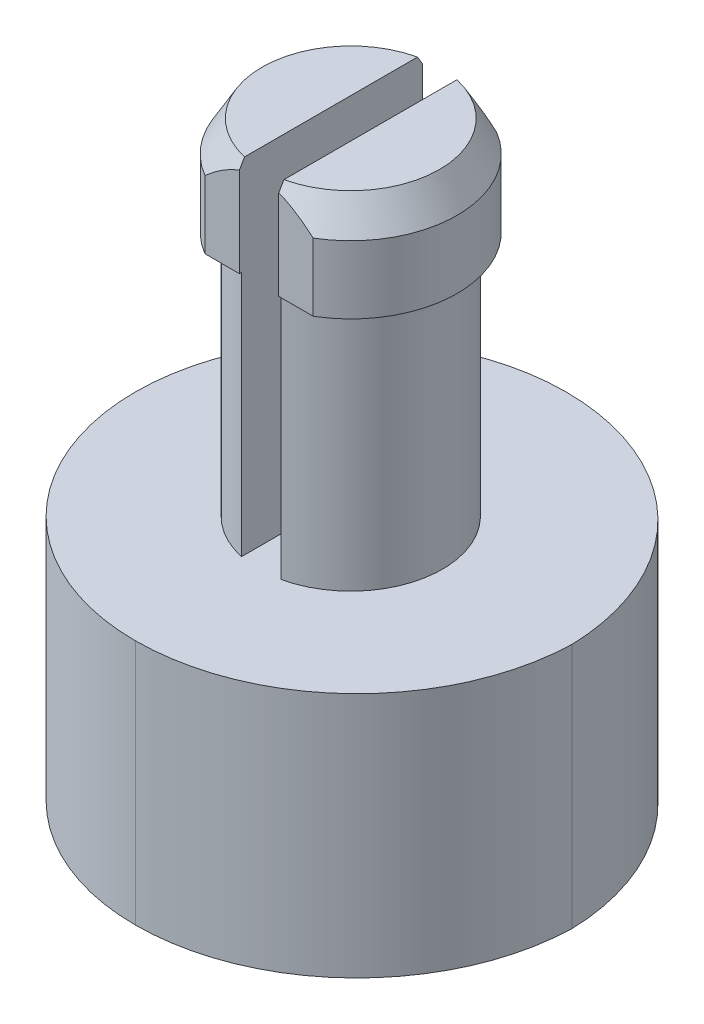
ISO-10303-21;
HEADER;
FILE_DESCRIPTION(('STEP AP214'),'2;1');
FILE_NAME('part.step','',(''),(''),'','','');
FILE_SCHEMA(('AUTOMOTIVE_DESIGN { 1 0 10303 214 1 1 1 1 }'));
ENDSEC;
DATA;
#1=APPLICATION_CONTEXT('core data for automotive mechanical design processes');
#2=APPLICATION_PROTOCOL_DEFINITION('international standard','automotive_design',2000,#1);
#3=PRODUCT_CONTEXT('',#1,'mechanical');
#4=PRODUCT('Part','Part','',(#3));
#5=PRODUCT_RELATED_PRODUCT_CATEGORY('part','',(#4));
#6=PRODUCT_DEFINITION_FORMATION('','',#4);
#7=PRODUCT_DEFINITION_CONTEXT('part definition',#1,'design');
#8=PRODUCT_DEFINITION('design','',#6,#7);
#9=PRODUCT_DEFINITION_SHAPE('','',#8);
#10=(LENGTH_UNIT() NAMED_UNIT(*) SI_UNIT(.MILLI.,.METRE.));
#11=(NAMED_UNIT(*) PLANE_ANGLE_UNIT() SI_UNIT($,.RADIAN.));
#12=(NAMED_UNIT(*) SI_UNIT($,.STERADIAN.) SOLID_ANGLE_UNIT());
#13=UNCERTAINTY_MEASURE_WITH_UNIT(LENGTH_MEASURE(1.E-05),#10,'distance_accuracy_value','');
#14=(GEOMETRIC_REPRESENTATION_CONTEXT(3) GLOBAL_UNCERTAINTY_ASSIGNED_CONTEXT((#13)) GLOBAL_UNIT_ASSIGNED_CONTEXT((#10,
#11,#12)) REPRESENTATION_CONTEXT('',''));
#15=CARTESIAN_POINT('',(0.,0.,0.));
#16=DIRECTION('',(0.,0.,1.));
#17=DIRECTION('',(1.,0.,0.));
#18=AXIS2_PLACEMENT_3D('',#15,#16,#17);
#19=CARTESIAN_POINT('',(9.652,6.35,5.55625));
#20=DIRECTION('',(0.,-1.,0.));
#21=DIRECTION('',(0.,0.,-1.));
#22=AXIS2_PLACEMENT_3D('',#19,#20,#21);
#23=CYLINDRICAL_SURFACE('',#22,2.365);
#24=DIRECTION('',(0.,-1.,0.));
#25=VECTOR('',#24,1.);
#26=CARTESIAN_POINT('',(9.144,6.35,7.86604674430457));
#27=LINE('',#26,#25);
#28=CARTESIAN_POINT('',(9.144,6.35,7.86604674430457));
#29=VERTEX_POINT('',#28);
#30=CARTESIAN_POINT('',(9.144,0.,7.86604674430457));
#31=VERTEX_POINT('',#30);
#32=EDGE_CURVE('E342',#29,#31,#27,.T.);
#33=ORIENTED_EDGE('',*,*,#32,.F.);
#34=CARTESIAN_POINT('',(9.652,6.35,5.55625));
#35=DIRECTION('',(0.,1.,0.));
#36=DIRECTION('',(0.,0.,1.));
#37=AXIS2_PLACEMENT_3D('',#34,#35,#36);
#38=CIRCLE('',#37,2.365);
#39=CARTESIAN_POINT('',(9.144,6.35,3.24645325569543));
#40=VERTEX_POINT('',#39);
#41=EDGE_CURVE('E369',#40,#29,#38,.T.);
#42=ORIENTED_EDGE('',*,*,#41,.F.);
#43=DIRECTION('',(0.,-1.,0.));
#44=VECTOR('',#43,1.);
#45=CARTESIAN_POINT('',(9.144,6.35,3.24645325569543));
#46=LINE('',#45,#44);
#47=CARTESIAN_POINT('',(9.144,0.,3.24645325569543));
#48=VERTEX_POINT('',#47);
#49=EDGE_CURVE('E337',#48,#40,#46,.F.);
#50=ORIENTED_EDGE('',*,*,#49,.F.);
#51=CARTESIAN_POINT('',(9.652,0.,5.55625));
#52=DIRECTION('',(0.,1.,0.));
#53=DIRECTION('',(0.,0.,1.));
#54=AXIS2_PLACEMENT_3D('',#51,#52,#53);
#55=CIRCLE('',#54,2.365);
#56=EDGE_CURVE('E366',#48,#31,#55,.T.);
#57=ORIENTED_EDGE('',*,*,#56,.T.);
#58=EDGE_LOOP('',(#33,#42,#50,#57));
#59=FACE_BOUND('',#58,.T.);
#60=ADVANCED_FACE('F35',(#59),#23,.T.);
#61=DIRECTION('',(0.,-1.,0.));
#62=VECTOR('',#61,1.);
#63=CARTESIAN_POINT('',(10.16,6.35,3.24645325569543));
#64=LINE('',#63,#62);
#65=CARTESIAN_POINT('',(10.16,6.35,3.24645325569543));
#66=VERTEX_POINT('',#65);
#67=CARTESIAN_POINT('',(10.16,0.,3.24645325569543));
#68=VERTEX_POINT('',#67);
#69=EDGE_CURVE('E324',#66,#68,#64,.T.);
#70=ORIENTED_EDGE('',*,*,#69,.F.);
#71=CARTESIAN_POINT('',(10.16,6.35,7.86604674430457));
#72=VERTEX_POINT('',#71);
#73=EDGE_CURVE('E192',#72,#66,#38,.T.);
#74=ORIENTED_EDGE('',*,*,#73,.F.);
#75=DIRECTION('',(0.,-1.,0.));
#76=VECTOR('',#75,1.);
#77=CARTESIAN_POINT('',(10.16,6.35,7.86604674430457));
#78=LINE('',#77,#76);
#79=CARTESIAN_POINT('',(10.16,0.,7.86604674430457));
#80=VERTEX_POINT('',#79);
#81=EDGE_CURVE('E330',#80,#72,#78,.F.);
#82=ORIENTED_EDGE('',*,*,#81,.F.);
#83=EDGE_CURVE('E370',#80,#68,#55,.T.);
#84=ORIENTED_EDGE('',*,*,#83,.T.);
#85=EDGE_LOOP('',(#70,#74,#82,#84));
#86=FACE_BOUND('',#85,.T.);
#87=ADVANCED_FACE('F291',(#86),#23,.T.);
#88=CARTESIAN_POINT('',(9.652,6.35,5.55625));
#89=DIRECTION('',(0.,1.,0.));
#90=DIRECTION('',(0.,0.,1.));
#91=AXIS2_PLACEMENT_3D('',#88,#89,#90);
#92=PLANE('',#91);
#93=DIRECTION('',(0.,0.,1.));
#94=VECTOR('',#93,1.);
#95=CARTESIAN_POINT('',(10.16,6.35,5.55625));
#96=LINE('',#95,#94);
#97=CARTESIAN_POINT('',(10.16,6.35,3.19125));
#98=VERTEX_POINT('',#97);
#99=EDGE_CURVE('E322',#98,#66,#96,.T.);
#100=ORIENTED_EDGE('',*,*,#99,.F.);
#101=DIRECTION('',(-1.,0.,0.));
#102=VECTOR('',#101,1.);
#103=CARTESIAN_POINT('',(8.25654631033488,6.35,3.19125));
#104=LINE('',#103,#102);
#105=CARTESIAN_POINT('',(11.0474536896651,6.35,3.19125));
#106=VERTEX_POINT('',#105);
#107=EDGE_CURVE('E355',#106,#98,#104,.T.);
#108=ORIENTED_EDGE('',*,*,#107,.F.);
#109=CARTESIAN_POINT('',(9.652,6.35,5.55625));
#110=DIRECTION('',(0.,1.,0.));
#111=DIRECTION('',(0.,0.,1.));
#112=AXIS2_PLACEMENT_3D('',#109,#110,#111);
#113=CIRCLE('',#112,2.746);
#114=CARTESIAN_POINT('',(11.0474536896651,6.35,7.92125));
#115=VERTEX_POINT('',#114);
#116=EDGE_CURVE('E351',#115,#106,#113,.T.);
#117=ORIENTED_EDGE('',*,*,#116,.F.);
#118=DIRECTION('',(1.,0.,0.));
#119=VECTOR('',#118,1.);
#120=CARTESIAN_POINT('',(8.25654631033488,6.35,7.92125));
#121=LINE('',#120,#119);
#122=CARTESIAN_POINT('',(10.16,6.35,7.92125));
#123=VERTEX_POINT('',#122);
#124=EDGE_CURVE('E347',#123,#115,#121,.T.);
#125=ORIENTED_EDGE('',*,*,#124,.F.);
#126=EDGE_CURVE('E325',#72,#123,#96,.T.);
#127=ORIENTED_EDGE('',*,*,#126,.F.);
#128=ORIENTED_EDGE('',*,*,#73,.T.);
#129=EDGE_LOOP('',(#100,#108,#117,#125,#127,#128));
#130=FACE_BOUND('',#129,.T.);
#131=ADVANCED_FACE('F241',(#130),#92,.F.);
#132=DIRECTION('',(0.,0.,-1.));
#133=VECTOR('',#132,1.);
#134=CARTESIAN_POINT('',(9.144,6.35,5.55625));
#135=LINE('',#134,#133);
#136=CARTESIAN_POINT('',(9.144,6.35,7.92125));
#137=VERTEX_POINT('',#136);
#138=EDGE_CURVE('E338',#137,#29,#135,.T.);
#139=ORIENTED_EDGE('',*,*,#138,.F.);
#140=CARTESIAN_POINT('',(8.25654631033488,6.35,7.92125));
#141=VERTEX_POINT('',#140);
#142=EDGE_CURVE('E348',#141,#137,#121,.T.);
#143=ORIENTED_EDGE('',*,*,#142,.F.);
#144=CARTESIAN_POINT('',(9.652,6.35,5.55625));
#145=DIRECTION('',(0.,1.,0.));
#146=DIRECTION('',(0.,0.,1.));
#147=AXIS2_PLACEMENT_3D('',#144,#145,#146);
#148=CIRCLE('',#147,2.746);
#149=CARTESIAN_POINT('',(8.25654631033488,6.35,3.19125));
#150=VERTEX_POINT('',#149);
#151=EDGE_CURVE('E344',#150,#141,#148,.T.);
#152=ORIENTED_EDGE('',*,*,#151,.F.);
#153=CARTESIAN_POINT('',(9.144,6.35,3.19125));
#154=VERTEX_POINT('',#153);
#155=EDGE_CURVE('E354',#154,#150,#104,.T.);
#156=ORIENTED_EDGE('',*,*,#155,.F.);
#157=EDGE_CURVE('E335',#40,#154,#135,.T.);
#158=ORIENTED_EDGE('',*,*,#157,.F.);
#159=ORIENTED_EDGE('',*,*,#41,.T.);
#160=EDGE_LOOP('',(#139,#143,#152,#156,#158,#159));
#161=FACE_BOUND('',#160,.T.);
#162=ADVANCED_FACE('F254',(#161),#92,.F.);
#163=CARTESIAN_POINT('',(8.25654631033488,8.89,7.92125));
#164=DIRECTION('',(0.,0.,-1.));
#165=DIRECTION('',(-1.,0.,0.));
#166=AXIS2_PLACEMENT_3D('',#163,#164,#165);
#167=PLANE('',#166);
#168=DIRECTION('',(0.,-1.,0.));
#169=VECTOR('',#168,1.);
#170=CARTESIAN_POINT('',(9.144,8.89,7.92125));
#171=LINE('',#170,#169);
#172=CARTESIAN_POINT('',(9.144,8.66272799383826,7.92125));
#173=VERTEX_POINT('',#172);
#174=EDGE_CURVE('E340',#173,#137,#171,.T.);
#175=ORIENTED_EDGE('',*,*,#174,.F.);
#176=CARTESIAN_POINT('',(9.144,8.66272799383826,7.92125));
#177=CARTESIAN_POINT('',(9.07897126611526,8.6390470148658,7.92125));
#178=CARTESIAN_POINT('',(9.01546129013959,8.61162898778716,7.92125));
#179=CARTESIAN_POINT('',(8.8915607613612,8.55085046003931,7.92125));
#180=CARTESIAN_POINT('',(8.83116151061707,8.51750783582994,7.92125));
#181=CARTESIAN_POINT('',(8.71378542197152,8.44661993005787,7.92125));
#182=CARTESIAN_POINT('',(8.65677980749075,8.40912132402861,7.92125));
#183=CARTESIAN_POINT('',(8.5451916908207,8.33063180561295,7.92125));
#184=CARTESIAN_POINT('',(8.4906105700596,8.28963894012723,7.92125));
#185=CARTESIAN_POINT('',(8.40638728555352,8.2229807806104,7.92125));
#186=CARTESIAN_POINT('',(8.37602017450452,8.19821960407329,7.92125));
#187=CARTESIAN_POINT('',(8.31584943740183,8.14783728650711,7.92125));
#188=CARTESIAN_POINT('',(8.28604781310869,8.12221375232005,7.92125));
#189=CARTESIAN_POINT('',(8.25654631033456,8.0962500000004,7.92125));
#190=B_SPLINE_CURVE_WITH_KNOTS('',3,(#176,#177,#178,#179,#180,#181,#182,#183,#184,#185,#186,
#187,#188,#189),.UNSPECIFIED.,.F.,.F.,(4,2,2,2,2,2,4),(0.,0.207289242942653,0.413963330448958,
0.618514980827537,0.823181723630413,0.940718514376475,1.05861389299853),.UNSPECIFIED.);
#191=CARTESIAN_POINT('',(8.25654631033488,8.09625,7.92125));
#192=VERTEX_POINT('',#191);
#193=EDGE_CURVE('E62',#173,#192,#190,.T.);
#194=ORIENTED_EDGE('',*,*,#193,.T.);
#195=DIRECTION('',(0.,-1.,0.));
#196=VECTOR('',#195,1.);
#197=CARTESIAN_POINT('',(8.25654631033488,8.89,7.92125));
#198=LINE('',#197,#196);
#199=EDGE_CURVE('E364',#192,#141,#198,.T.);
#200=ORIENTED_EDGE('',*,*,#199,.T.);
#201=ORIENTED_EDGE('',*,*,#142,.T.);
#202=EDGE_LOOP('',(#175,#194,#200,#201));
#203=FACE_BOUND('',#202,.T.);
#204=ADVANCED_FACE('F250',(#203),#167,.F.);
#205=DIRECTION('',(0.,-1.,0.));
#206=VECTOR('',#205,1.);
#207=CARTESIAN_POINT('',(11.0474536896651,8.89,7.92125));
#208=LINE('',#207,#206);
#209=CARTESIAN_POINT('',(11.0474536896651,8.09625,7.92125));
#210=VERTEX_POINT('',#209);
#211=EDGE_CURVE('E362',#210,#115,#208,.T.);
#212=ORIENTED_EDGE('',*,*,#211,.F.);
#213=CARTESIAN_POINT('',(11.0474536896651,8.09625,7.92125));
#214=CARTESIAN_POINT('',(10.9891313426045,8.14752147950845,7.92125));
#215=CARTESIAN_POINT('',(10.9296323591011,8.19756383661311,7.92125));
#216=CARTESIAN_POINT('',(10.8075145417379,8.29436242360265,7.92125));
#217=CARTESIAN_POINT('',(10.7448807638123,8.34109970823,7.92125));
#218=CARTESIAN_POINT('',(10.6176219025196,8.42900412363934,7.92125));
#219=CARTESIAN_POINT('',(10.5530615079704,8.47026380538079,7.92125));
#220=CARTESIAN_POINT('',(10.4205320210095,8.54666017956444,7.92125));
#221=CARTESIAN_POINT('',(10.3525715716221,8.58181147328913,7.92125));
#222=CARTESIAN_POINT('',(10.2626889087194,8.62193408697179,7.92125));
#223=CARTESIAN_POINT('',(10.2423906805197,8.63059297138322,7.92125));
#224=CARTESIAN_POINT('',(10.2014443704591,8.64720885797594,7.92125));
#225=CARTESIAN_POINT('',(10.1807954814522,8.65516386904612,7.92125));
#226=CARTESIAN_POINT('',(10.16,8.66272799383834,7.92125));
#227=B_SPLINE_CURVE_WITH_KNOTS('',3,(#213,#214,#215,#216,#217,#218,#219,#220,#221,#222,#223,
#224,#225,#226),.UNSPECIFIED.,.F.,.F.,(4,2,2,2,2,2,4),(0.,0.233057041170053,0.467356798114246,
0.696980507606663,0.926047547621464,0.9922400607786,1.05861420167723),.UNSPECIFIED.);
#228=CARTESIAN_POINT('',(10.16,8.66272799383828,7.92125));
#229=VERTEX_POINT('',#228);
#230=EDGE_CURVE('E257',#210,#229,#227,.T.);
#231=ORIENTED_EDGE('',*,*,#230,.T.);
#232=DIRECTION('',(0.,1.,0.));
#233=VECTOR('',#232,1.);
#234=CARTESIAN_POINT('',(10.16,8.89,7.92125));
#235=LINE('',#234,#233);
#236=EDGE_CURVE('E327',#123,#229,#235,.T.);
#237=ORIENTED_EDGE('',*,*,#236,.F.);
#238=ORIENTED_EDGE('',*,*,#124,.T.);
#239=EDGE_LOOP('',(#212,#231,#237,#238));
#240=FACE_BOUND('',#239,.T.);
#241=ADVANCED_FACE('F239',(#240),#167,.F.);
#242=CARTESIAN_POINT('',(8.25654631033488,8.89,3.19125));
#243=DIRECTION('',(0.,0.,1.));
#244=DIRECTION('',(1.,0.,0.));
#245=AXIS2_PLACEMENT_3D('',#242,#243,#244);
#246=PLANE('',#245);
#247=DIRECTION('',(0.,-1.,0.));
#248=VECTOR('',#247,1.);
#249=CARTESIAN_POINT('',(8.25654631033488,8.89,3.19125));
#250=LINE('',#249,#248);
#251=CARTESIAN_POINT('',(8.25654631033488,8.09625,3.19125));
#252=VERTEX_POINT('',#251);
#253=EDGE_CURVE('E358',#252,#150,#250,.T.);
#254=ORIENTED_EDGE('',*,*,#253,.F.);
#255=CARTESIAN_POINT('',(8.25654631033488,8.09625,3.19125));
#256=CARTESIAN_POINT('',(8.3148686573955,8.14752147950845,3.19125));
#257=CARTESIAN_POINT('',(8.37436764089892,8.1975638366131,3.19125));
#258=CARTESIAN_POINT('',(8.49648545826208,8.29436242360264,3.19125));
#259=CARTESIAN_POINT('',(8.55911923618774,8.34109970822998,3.19125));
#260=CARTESIAN_POINT('',(8.68637809748044,8.42900412363933,3.19125));
#261=CARTESIAN_POINT('',(8.75093849202957,8.47026380538077,3.19125));
#262=CARTESIAN_POINT('',(8.88346797899055,8.54666017956442,3.19125));
#263=CARTESIAN_POINT('',(8.95142842837788,8.58181147328912,3.19125));
#264=CARTESIAN_POINT('',(9.04131109128064,8.62193408697178,3.19125));
#265=CARTESIAN_POINT('',(9.06160931948031,8.63059297138321,3.19125));
#266=CARTESIAN_POINT('',(9.10255562954091,8.64720885797592,3.19125));
#267=CARTESIAN_POINT('',(9.12320451854777,8.65516386904611,3.19125));
#268=CARTESIAN_POINT('',(9.14399999999997,8.66272799383833,3.19125));
#269=B_SPLINE_CURVE_WITH_KNOTS('',3,(#255,#256,#257,#258,#259,#260,#261,#262,#263,#264,#265,
#266,#267,#268),.UNSPECIFIED.,.F.,.F.,(4,2,2,2,2,2,4),(0.,0.233057041170051,0.467356798114243,
0.696980507606659,0.926047547621459,0.992240060778597,1.05861420167722),.UNSPECIFIED.);
#270=CARTESIAN_POINT('',(9.144,8.66272799383826,3.19125));
#271=VERTEX_POINT('',#270);
#272=EDGE_CURVE('E11',#252,#271,#269,.T.);
#273=ORIENTED_EDGE('',*,*,#272,.T.);
#274=DIRECTION('',(0.,1.,0.));
#275=VECTOR('',#274,1.);
#276=CARTESIAN_POINT('',(9.144,8.89,3.19125));
#277=LINE('',#276,#275);
#278=EDGE_CURVE('E332',#154,#271,#277,.T.);
#279=ORIENTED_EDGE('',*,*,#278,.F.);
#280=ORIENTED_EDGE('',*,*,#155,.T.);
#281=EDGE_LOOP('',(#254,#273,#279,#280));
#282=FACE_BOUND('',#281,.T.);
#283=ADVANCED_FACE('F233',(#282),#246,.F.);
#284=DIRECTION('',(0.,-1.,0.));
#285=VECTOR('',#284,1.);
#286=CARTESIAN_POINT('',(10.16,8.89,3.19125));
#287=LINE('',#286,#285);
#288=CARTESIAN_POINT('',(10.16,8.66272799383828,3.19125));
#289=VERTEX_POINT('',#288);
#290=EDGE_CURVE('E320',#289,#98,#287,.T.);
#291=ORIENTED_EDGE('',*,*,#290,.F.);
#292=CARTESIAN_POINT('',(10.16,8.66272799383828,3.19125));
#293=CARTESIAN_POINT('',(10.2250287338847,8.63904701486581,3.19125));
#294=CARTESIAN_POINT('',(10.2885387098604,8.61162898778718,3.19125));
#295=CARTESIAN_POINT('',(10.4124392386388,8.55085046003933,3.19125));
#296=CARTESIAN_POINT('',(10.4728384893829,8.51750783582996,3.19125));
#297=CARTESIAN_POINT('',(10.5902145780285,8.44661993005788,3.19125));
#298=CARTESIAN_POINT('',(10.6472201925092,8.40912132402863,3.19125));
#299=CARTESIAN_POINT('',(10.7588083091793,8.33063180561296,3.19125));
#300=CARTESIAN_POINT('',(10.8133894299404,8.28963894012725,3.19125));
#301=CARTESIAN_POINT('',(10.8976127144465,8.22298078061042,3.19125));
#302=CARTESIAN_POINT('',(10.9279798254955,8.1982196040733,3.19125));
#303=CARTESIAN_POINT('',(10.9881505625982,8.14783728650712,3.19125));
#304=CARTESIAN_POINT('',(11.0179521868913,8.12221375232006,3.19125));
#305=CARTESIAN_POINT('',(11.0474536896654,8.09625000000041,3.19125));
#306=B_SPLINE_CURVE_WITH_KNOTS('',3,(#292,#293,#294,#295,#296,#297,#298,#299,#300,#301,#302,
#303,#304,#305),.UNSPECIFIED.,.F.,.F.,(4,2,2,2,2,2,4),(0.,0.207289242942653,0.413963330448959,
0.61851498082754,0.823181723630415,0.94071851437648,1.05861389299854),.UNSPECIFIED.);
#307=CARTESIAN_POINT('',(11.0474536896651,8.09625,3.19125));
#308=VERTEX_POINT('',#307);
#309=EDGE_CURVE('E227',#289,#308,#306,.T.);
#310=ORIENTED_EDGE('',*,*,#309,.T.);
#311=DIRECTION('',(0.,-1.,0.));
#312=VECTOR('',#311,1.);
#313=CARTESIAN_POINT('',(11.0474536896651,8.89,3.19125));
#314=LINE('',#313,#312);
#315=EDGE_CURVE('E360',#308,#106,#314,.T.);
#316=ORIENTED_EDGE('',*,*,#315,.T.);
#317=ORIENTED_EDGE('',*,*,#107,.T.);
#318=EDGE_LOOP('',(#291,#310,#316,#317));
#319=FACE_BOUND('',#318,.T.);
#320=ADVANCED_FACE('F238',(#319),#246,.F.);
#321=CARTESIAN_POINT('',(9.652,8.89,5.55625));
#322=DIRECTION('',(0.,1.,0.));
#323=DIRECTION('',(0.,0.,1.));
#324=AXIS2_PLACEMENT_3D('',#321,#322,#323);
#325=PLANE('',#324);
#326=DIRECTION('',(0.,0.,-1.));
#327=VECTOR('',#326,1.);
#328=CARTESIAN_POINT('',(9.144,8.89,5.55625));
#329=LINE('',#328,#327);
#330=CARTESIAN_POINT('',(9.144,8.89,7.78686346407479));
#331=VERTEX_POINT('',#330);
#332=CARTESIAN_POINT('',(9.144,8.89,3.32563653592521));
#333=VERTEX_POINT('',#332);
#334=EDGE_CURVE('E195',#331,#333,#329,.T.);
#335=ORIENTED_EDGE('',*,*,#334,.T.);
#336=CARTESIAN_POINT('',(9.652,8.89,5.55625));
#337=DIRECTION('',(0.,1.,0.));
#338=DIRECTION('',(0.,0.,1.));
#339=AXIS2_PLACEMENT_3D('',#336,#337,#338);
#340=CIRCLE('',#339,2.28772822383073);
#341=EDGE_CURVE('E395',#333,#331,#340,.T.);
#342=ORIENTED_EDGE('',*,*,#341,.T.);
#343=EDGE_LOOP('',(#335,#342));
#344=FACE_BOUND('',#343,.T.);
#345=ADVANCED_FACE('F279',(#344),#325,.T.);
#346=DIRECTION('',(0.,0.,1.));
#347=VECTOR('',#346,1.);
#348=CARTESIAN_POINT('',(10.16,8.89,5.55625));
#349=LINE('',#348,#347);
#350=CARTESIAN_POINT('',(10.16,8.89,3.3256365359252));
#351=VERTEX_POINT('',#350);
#352=CARTESIAN_POINT('',(10.16,8.89,7.7868634640748));
#353=VERTEX_POINT('',#352);
#354=EDGE_CURVE('E190',#351,#353,#349,.T.);
#355=ORIENTED_EDGE('',*,*,#354,.T.);
#356=CARTESIAN_POINT('',(9.652,8.89,5.55625));
#357=DIRECTION('',(0.,1.,0.));
#358=DIRECTION('',(0.,0.,1.));
#359=AXIS2_PLACEMENT_3D('',#356,#357,#358);
#360=CIRCLE('',#359,2.28772822383075);
#361=EDGE_CURVE('E198',#353,#351,#360,.T.);
#362=ORIENTED_EDGE('',*,*,#361,.T.);
#363=EDGE_LOOP('',(#355,#362));
#364=FACE_BOUND('',#363,.T.);
#365=ADVANCED_FACE('F282',(#364),#325,.T.);
#366=CARTESIAN_POINT('',(-6.477,-6.35,11.1125));
#367=DIRECTION('',(0.,1.,0.));
#368=DIRECTION('',(0.,0.,1.));
#369=AXIS2_PLACEMENT_3D('',#366,#367,#368);
#370=PLANE('',#369);
#371=CARTESIAN_POINT('',(9.652,-6.35,5.3975));
#372=DIRECTION('',(0.,1.,0.));
#373=DIRECTION('',(0.,0.,1.));
#374=AXIS2_PLACEMENT_3D('',#371,#372,#373);
#375=CIRCLE('',#374,5.715);
#376=CARTESIAN_POINT('',(15.3647947134043,-6.35,5.55625));
#377=VERTEX_POINT('',#376);
#378=CARTESIAN_POINT('',(9.652,-6.35,11.1125));
#379=VERTEX_POINT('',#378);
#380=EDGE_CURVE('E168',#377,#379,#375,.F.);
#381=ORIENTED_EDGE('',*,*,#380,.T.);
#382=CARTESIAN_POINT('',(9.652,-6.35,5.55625));
#383=DIRECTION('',(0.,-1.,0.));
#384=DIRECTION('',(0.,0.,1.));
#385=AXIS2_PLACEMENT_3D('',#382,#383,#384);
#386=CIRCLE('',#385,5.55625);
#387=CARTESIAN_POINT('',(9.652,-6.35,0.));
#388=VERTEX_POINT('',#387);
#389=EDGE_CURVE('E160',#379,#388,#386,.T.);
#390=ORIENTED_EDGE('',*,*,#389,.T.);
#391=CARTESIAN_POINT('',(9.652,-6.35,5.715));
#392=DIRECTION('',(0.,1.,0.));
#393=DIRECTION('',(0.,0.,1.));
#394=AXIS2_PLACEMENT_3D('',#391,#392,#393);
#395=CIRCLE('',#394,5.715);
#396=EDGE_CURVE('E173',#388,#377,#395,.F.);
#397=ORIENTED_EDGE('',*,*,#396,.T.);
#398=EDGE_LOOP('',(#381,#390,#397));
#399=FACE_BOUND('',#398,.T.);
#400=ADVANCED_FACE('F172',(#399),#370,.F.);
#401=CARTESIAN_POINT('',(3.302,0.,11.1125));
#402=DIRECTION('',(0.,1.,0.));
#403=DIRECTION('',(0.,0.,1.));
#404=AXIS2_PLACEMENT_3D('',#401,#402,#403);
#405=PLANE('',#404);
#406=CARTESIAN_POINT('',(9.652,0.,5.55625));
#407=DIRECTION('',(0.,-1.,0.));
#408=DIRECTION('',(0.,0.,1.));
#409=AXIS2_PLACEMENT_3D('',#406,#407,#408);
#410=CIRCLE('',#409,5.55625);
#411=CARTESIAN_POINT('',(9.652,0.,11.1125));
#412=VERTEX_POINT('',#411);
#413=CARTESIAN_POINT('',(9.652,0.,0.));
#414=VERTEX_POINT('',#413);
#415=EDGE_CURVE('E163',#412,#414,#410,.T.);
#416=ORIENTED_EDGE('',*,*,#415,.F.);
#417=CARTESIAN_POINT('',(9.652,0.,5.3975));
#418=DIRECTION('',(0.,1.,0.));
#419=DIRECTION('',(0.,0.,1.));
#420=AXIS2_PLACEMENT_3D('',#417,#418,#419);
#421=CIRCLE('',#420,5.715);
#422=CARTESIAN_POINT('',(15.3647947134043,0.,5.55625));
#423=VERTEX_POINT('',#422);
#424=EDGE_CURVE('E181',#412,#423,#421,.T.);
#425=ORIENTED_EDGE('',*,*,#424,.T.);
#426=CARTESIAN_POINT('',(9.652,0.,5.715));
#427=DIRECTION('',(0.,1.,0.));
#428=DIRECTION('',(0.,0.,1.));
#429=AXIS2_PLACEMENT_3D('',#426,#427,#428);
#430=CIRCLE('',#429,5.715);
#431=EDGE_CURVE('E183',#423,#414,#430,.T.);
#432=ORIENTED_EDGE('',*,*,#431,.T.);
#433=EDGE_LOOP('',(#416,#425,#432));
#434=FACE_BOUND('',#433,.T.);
#435=DIRECTION('',(0.,0.,-1.));
#436=VECTOR('',#435,1.);
#437=CARTESIAN_POINT('',(9.144,0.,11.1125));
#438=LINE('',#437,#436);
#439=EDGE_CURVE('E318',#31,#48,#438,.T.);
#440=ORIENTED_EDGE('',*,*,#439,.F.);
#441=ORIENTED_EDGE('',*,*,#56,.F.);
#442=EDGE_LOOP('',(#440,#441));
#443=FACE_BOUND('',#442,.T.);
#444=DIRECTION('',(0.,0.,-1.));
#445=VECTOR('',#444,1.);
#446=CARTESIAN_POINT('',(10.16,0.,11.1125));
#447=LINE('',#446,#445);
#448=EDGE_CURVE('E176',#80,#68,#447,.T.);
#449=ORIENTED_EDGE('',*,*,#448,.T.);
#450=ORIENTED_EDGE('',*,*,#83,.F.);
#451=EDGE_LOOP('',(#449,#450));
#452=FACE_BOUND('',#451,.T.);
#453=ADVANCED_FACE('F301',(#434,#443,#452),#405,.T.);
#454=CARTESIAN_POINT('',(9.652,0.,5.3975));
#455=DIRECTION('',(0.,-1.,0.));
#456=DIRECTION('',(0.,0.,-1.));
#457=AXIS2_PLACEMENT_3D('',#454,#455,#456);
#458=CYLINDRICAL_SURFACE('',#457,5.715);
#459=DIRECTION('',(0.,-1.,0.));
#460=VECTOR('',#459,1.);
#461=CARTESIAN_POINT('',(15.3647947134043,-3.175,5.55625));
#462=LINE('',#461,#460);
#463=EDGE_CURVE('E169',#423,#377,#462,.T.);
#464=ORIENTED_EDGE('',*,*,#463,.F.);
#465=ORIENTED_EDGE('',*,*,#424,.F.);
#466=DIRECTION('',(0.,-1.,0.));
#467=VECTOR('',#466,1.);
#468=CARTESIAN_POINT('',(9.652,0.,11.1125));
#469=LINE('',#468,#467);
#470=EDGE_CURVE('E188',#379,#412,#469,.F.);
#471=ORIENTED_EDGE('',*,*,#470,.F.);
#472=ORIENTED_EDGE('',*,*,#380,.F.);
#473=EDGE_LOOP('',(#464,#465,#471,#472));
#474=FACE_BOUND('',#473,.T.);
#475=ADVANCED_FACE('F221',(#474),#458,.T.);
#476=CARTESIAN_POINT('',(9.652,0.,5.715));
#477=DIRECTION('',(0.,1.,0.));
#478=DIRECTION('',(0.,0.,1.));
#479=AXIS2_PLACEMENT_3D('',#476,#477,#478);
#480=CYLINDRICAL_SURFACE('',#479,5.715);
#481=ORIENTED_EDGE('',*,*,#431,.F.);
#482=ORIENTED_EDGE('',*,*,#463,.T.);
#483=ORIENTED_EDGE('',*,*,#396,.F.);
#484=DIRECTION('',(0.,-1.,0.));
#485=VECTOR('',#484,1.);
#486=CARTESIAN_POINT('',(9.652,-6.35,0.));
#487=LINE('',#486,#485);
#488=EDGE_CURVE('E157',#414,#388,#487,.T.);
#489=ORIENTED_EDGE('',*,*,#488,.F.);
#490=EDGE_LOOP('',(#481,#482,#483,#489));
#491=FACE_BOUND('',#490,.T.);
#492=ADVANCED_FACE('F179',(#491),#480,.T.);
#493=CARTESIAN_POINT('',(9.652,8.89,5.55625));
#494=DIRECTION('',(0.,-1.,0.));
#495=DIRECTION('',(0.,0.,-1.));
#496=AXIS2_PLACEMENT_3D('',#493,#494,#495);
#497=CYLINDRICAL_SURFACE('',#496,2.746);
#498=ORIENTED_EDGE('',*,*,#199,.F.);
#499=CARTESIAN_POINT('',(9.652,8.09625,5.55625));
#500=DIRECTION('',(0.,1.,0.));
#501=DIRECTION('',(0.,0.,1.));
#502=AXIS2_PLACEMENT_3D('',#499,#500,#501);
#503=CIRCLE('',#502,2.746);
#504=EDGE_CURVE('E48',#192,#252,#503,.F.);
#505=ORIENTED_EDGE('',*,*,#504,.T.);
#506=ORIENTED_EDGE('',*,*,#253,.T.);
#507=ORIENTED_EDGE('',*,*,#151,.T.);
#508=EDGE_LOOP('',(#498,#505,#506,#507));
#509=FACE_BOUND('',#508,.T.);
#510=ADVANCED_FACE('F248',(#509),#497,.T.);
#511=CARTESIAN_POINT('',(9.652,8.89,5.55625));
#512=DIRECTION('',(0.,-1.,0.));
#513=DIRECTION('',(0.,0.,-1.));
#514=AXIS2_PLACEMENT_3D('',#511,#512,#513);
#515=CYLINDRICAL_SURFACE('',#514,2.746);
#516=ORIENTED_EDGE('',*,*,#315,.F.);
#517=CARTESIAN_POINT('',(9.652,8.09625,5.55625));
#518=DIRECTION('',(0.,1.,0.));
#519=DIRECTION('',(0.,0.,1.));
#520=AXIS2_PLACEMENT_3D('',#517,#518,#519);
#521=CIRCLE('',#520,2.746);
#522=EDGE_CURVE('E232',#308,#210,#521,.F.);
#523=ORIENTED_EDGE('',*,*,#522,.T.);
#524=ORIENTED_EDGE('',*,*,#211,.T.);
#525=ORIENTED_EDGE('',*,*,#116,.T.);
#526=EDGE_LOOP('',(#516,#523,#524,#525));
#527=FACE_BOUND('',#526,.T.);
#528=ADVANCED_FACE('F243',(#527),#515,.T.);
#529=CARTESIAN_POINT('',(9.144,8.89,11.1125));
#530=DIRECTION('',(1.,0.,0.));
#531=DIRECTION('',(0.,0.,-1.));
#532=AXIS2_PLACEMENT_3D('',#529,#530,#531);
#533=PLANE('',#532);
#534=ORIENTED_EDGE('',*,*,#334,.F.);
#535=CARTESIAN_POINT('',(9.144,8.89,7.78686346407479));
#536=CARTESIAN_POINT('',(9.144,8.85213471420483,7.80928385149481));
#537=CARTESIAN_POINT('',(9.144,8.8142627374133,7.83169292322642));
#538=CARTESIAN_POINT('',(9.144,8.73850540202598,7.87648843520138));
#539=CARTESIAN_POINT('',(9.144,8.70062004343027,7.89887487544484));
#540=CARTESIAN_POINT('',(9.144,8.66272799383826,7.92125));
#541=B_SPLINE_CURVE_WITH_KNOTS('',3,(#535,#536,#537,#538,#539,#540),.UNSPECIFIED.,.F.,.F.,(4,2,
4),(0.,0.132015446436165,0.264030892215421),.UNSPECIFIED.);
#542=EDGE_CURVE('E267',#331,#173,#541,.T.);
#543=ORIENTED_EDGE('',*,*,#542,.T.);
#544=ORIENTED_EDGE('',*,*,#174,.T.);
#545=ORIENTED_EDGE('',*,*,#138,.T.);
#546=ORIENTED_EDGE('',*,*,#32,.T.);
#547=ORIENTED_EDGE('',*,*,#439,.T.);
#548=ORIENTED_EDGE('',*,*,#49,.T.);
#549=ORIENTED_EDGE('',*,*,#157,.T.);
#550=ORIENTED_EDGE('',*,*,#278,.T.);
#551=CARTESIAN_POINT('',(9.144,8.66272799383826,3.19125));
#552=CARTESIAN_POINT('',(9.144,8.70062004343027,3.21362512455516));
#553=CARTESIAN_POINT('',(9.144,8.73850540202598,3.23601156479862));
#554=CARTESIAN_POINT('',(9.144,8.8142627374133,3.28080707677358));
#555=CARTESIAN_POINT('',(9.144,8.85213471420483,3.30321614850519));
#556=CARTESIAN_POINT('',(9.144,8.89,3.32563653592521));
#557=B_SPLINE_CURVE_WITH_KNOTS('',3,(#551,#552,#553,#554,#555,#556),.UNSPECIFIED.,.F.,.F.,(4,2,
4),(0.,0.132015445779256,0.264030892215421),.UNSPECIFIED.);
#558=EDGE_CURVE('E272',#271,#333,#557,.T.);
#559=ORIENTED_EDGE('',*,*,#558,.T.);
#560=EDGE_LOOP('',(#534,#543,#544,#545,#546,#547,#548,#549,#550,#559));
#561=FACE_BOUND('',#560,.T.);
#562=ADVANCED_FACE('F247',(#561),#533,.T.);
#563=CARTESIAN_POINT('',(10.16,8.89,11.1125));
#564=DIRECTION('',(-1.,0.,0.));
#565=DIRECTION('',(0.,-1.,0.));
#566=AXIS2_PLACEMENT_3D('',#563,#564,#565);
#567=PLANE('',#566);
#568=ORIENTED_EDGE('',*,*,#354,.F.);
#569=CARTESIAN_POINT('',(10.16,8.89,3.3256365359252));
#570=CARTESIAN_POINT('',(10.16,8.85213471420483,3.30321614850518));
#571=CARTESIAN_POINT('',(10.16,8.8142627374133,3.28080707677357));
#572=CARTESIAN_POINT('',(10.16,8.73850540202599,3.23601156479861));
#573=CARTESIAN_POINT('',(10.16,8.70062004343029,3.21362512455516));
#574=CARTESIAN_POINT('',(10.16,8.66272799383828,3.19125));
#575=B_SPLINE_CURVE_WITH_KNOTS('',3,(#569,#570,#571,#572,#573,#574),.UNSPECIFIED.,.F.,.F.,(4,2,
4),(0.,0.132015446436157,0.2640308922154),.UNSPECIFIED.);
#576=EDGE_CURVE('E207',#351,#289,#575,.T.);
#577=ORIENTED_EDGE('',*,*,#576,.T.);
#578=ORIENTED_EDGE('',*,*,#290,.T.);
#579=ORIENTED_EDGE('',*,*,#99,.T.);
#580=ORIENTED_EDGE('',*,*,#69,.T.);
#581=ORIENTED_EDGE('',*,*,#448,.F.);
#582=ORIENTED_EDGE('',*,*,#81,.T.);
#583=ORIENTED_EDGE('',*,*,#126,.T.);
#584=ORIENTED_EDGE('',*,*,#236,.T.);
#585=CARTESIAN_POINT('',(10.16,8.66272799383828,7.92125));
#586=CARTESIAN_POINT('',(10.16,8.70062004343029,7.89887487544484));
#587=CARTESIAN_POINT('',(10.16,8.73850540202599,7.87648843520139));
#588=CARTESIAN_POINT('',(10.16,8.8142627374133,7.83169292322643));
#589=CARTESIAN_POINT('',(10.16,8.85213471420483,7.80928385149482));
#590=CARTESIAN_POINT('',(10.16,8.89,7.7868634640748));
#591=B_SPLINE_CURVE_WITH_KNOTS('',3,(#585,#586,#587,#588,#589,#590),.UNSPECIFIED.,.F.,.F.,(4,2,
4),(0.,0.132015445779243,0.2640308922154),.UNSPECIFIED.);
#592=EDGE_CURVE('E201',#229,#353,#591,.T.);
#593=ORIENTED_EDGE('',*,*,#592,.T.);
#594=EDGE_LOOP('',(#568,#577,#578,#579,#580,#581,#582,#583,#584,#593));
#595=FACE_BOUND('',#594,.T.);
#596=ADVANCED_FACE('F212',(#595),#567,.T.);
#597=CARTESIAN_POINT('',(9.652,8.89,5.55625));
#598=DIRECTION('',(0.,-1.,0.));
#599=DIRECTION('',(0.,0.,-1.));
#600=AXIS2_PLACEMENT_3D('',#597,#598,#599);
#601=CONICAL_SURFACE('',#600,2.28772822383075,0.523598775598291);
#602=ORIENTED_EDGE('',*,*,#230,.F.);
#603=ORIENTED_EDGE('',*,*,#522,.F.);
#604=ORIENTED_EDGE('',*,*,#309,.F.);
#605=ORIENTED_EDGE('',*,*,#576,.F.);
#606=ORIENTED_EDGE('',*,*,#361,.F.);
#607=ORIENTED_EDGE('',*,*,#592,.F.);
#608=EDGE_LOOP('',(#602,#603,#604,#605,#606,#607));
#609=FACE_BOUND('',#608,.T.);
#610=ADVANCED_FACE('F216',(#609),#601,.T.);
#611=CARTESIAN_POINT('',(9.652,8.89,5.55625));
#612=DIRECTION('',(0.,-1.,0.));
#613=DIRECTION('',(0.,0.,-1.));
#614=AXIS2_PLACEMENT_3D('',#611,#612,#613);
#615=CONICAL_SURFACE('',#614,2.28772822383073,0.523598775598298);
#616=ORIENTED_EDGE('',*,*,#272,.F.);
#617=ORIENTED_EDGE('',*,*,#504,.F.);
#618=ORIENTED_EDGE('',*,*,#193,.F.);
#619=ORIENTED_EDGE('',*,*,#542,.F.);
#620=ORIENTED_EDGE('',*,*,#341,.F.);
#621=ORIENTED_EDGE('',*,*,#558,.F.);
#622=EDGE_LOOP('',(#616,#617,#618,#619,#620,#621));
#623=FACE_BOUND('',#622,.T.);
#624=ADVANCED_FACE('F37',(#623),#615,.T.);
#625=CARTESIAN_POINT('',(9.652,-6.35,5.55625));
#626=DIRECTION('',(0.,1.,0.));
#627=DIRECTION('',(0.,0.,1.));
#628=AXIS2_PLACEMENT_3D('',#625,#626,#627);
#629=CYLINDRICAL_SURFACE('',#628,5.55625);
#630=ORIENTED_EDGE('',*,*,#415,.T.);
#631=ORIENTED_EDGE('',*,*,#488,.T.);
#632=ORIENTED_EDGE('',*,*,#389,.F.);
#633=ORIENTED_EDGE('',*,*,#470,.T.);
#634=EDGE_LOOP('',(#630,#631,#632,#633));
#635=FACE_BOUND('',#634,.T.);
#636=ADVANCED_FACE('F159',(#635),#629,.T.);
#637=CLOSED_SHELL('',(#60,#87,#131,#162,#204,#241,#283,#320,#345,#365,#400,#453,#475,#492,#510,
#528,#562,#596,#610,#624,#636));
#638=MANIFOLD_SOLID_BREP('B2',#637);
#639=ADVANCED_BREP_SHAPE_REPRESENTATION('',(#18,#638),#14);
#640=SHAPE_DEFINITION_REPRESENTATION(#9,#639);
ENDSEC;
END-ISO-10303-21;
